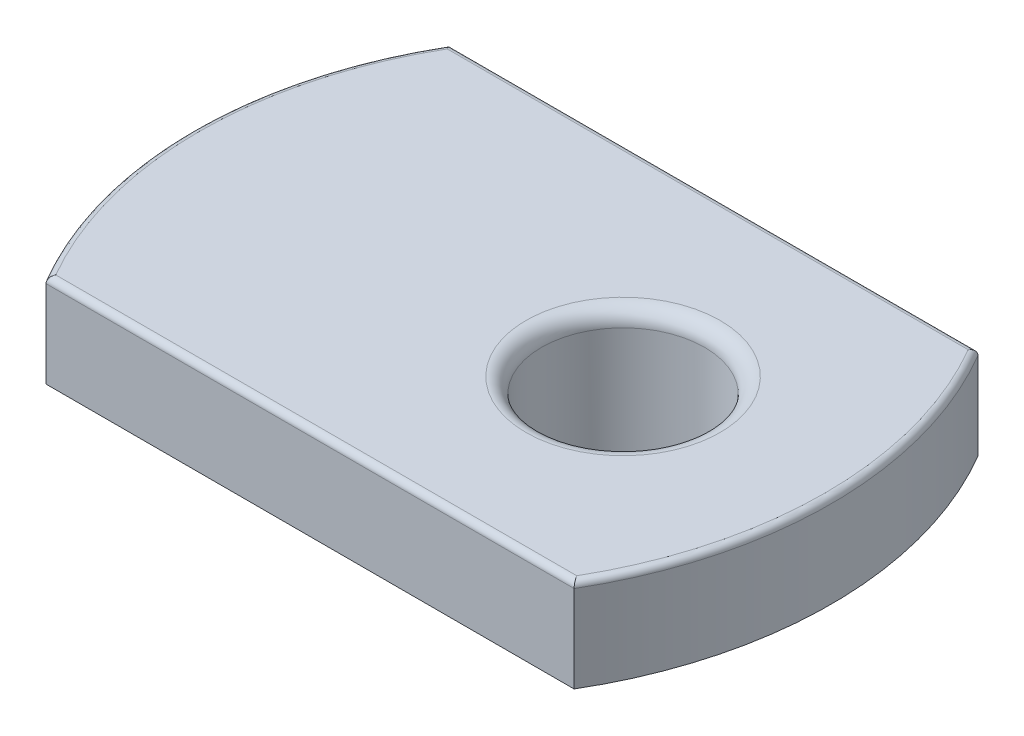
ISO-10303-21;
HEADER;
FILE_DESCRIPTION(('STEP AP214'),'2;1');
FILE_NAME('part.step','',(''),(''),'','','');
FILE_SCHEMA(('AUTOMOTIVE_DESIGN { 1 0 10303 214 1 1 1 1 }'));
ENDSEC;
DATA;
#1=APPLICATION_CONTEXT('core data for automotive mechanical design processes');
#2=APPLICATION_PROTOCOL_DEFINITION('international standard','automotive_design',2000,#1);
#3=PRODUCT_CONTEXT('',#1,'mechanical');
#4=PRODUCT('Part','Part','',(#3));
#5=PRODUCT_RELATED_PRODUCT_CATEGORY('part','',(#4));
#6=PRODUCT_DEFINITION_FORMATION('','',#4);
#7=PRODUCT_DEFINITION_CONTEXT('part definition',#1,'design');
#8=PRODUCT_DEFINITION('design','',#6,#7);
#9=PRODUCT_DEFINITION_SHAPE('','',#8);
#10=(LENGTH_UNIT() NAMED_UNIT(*) SI_UNIT(.MILLI.,.METRE.));
#11=(NAMED_UNIT(*) PLANE_ANGLE_UNIT() SI_UNIT($,.RADIAN.));
#12=(NAMED_UNIT(*) SI_UNIT($,.STERADIAN.) SOLID_ANGLE_UNIT());
#13=UNCERTAINTY_MEASURE_WITH_UNIT(LENGTH_MEASURE(1.E-05),#10,'distance_accuracy_value','');
#14=(GEOMETRIC_REPRESENTATION_CONTEXT(3) GLOBAL_UNCERTAINTY_ASSIGNED_CONTEXT((#13)) GLOBAL_UNIT_ASSIGNED_CONTEXT((#10,
#11,#12)) REPRESENTATION_CONTEXT('',''));
#15=CARTESIAN_POINT('',(0.,0.,0.));
#16=DIRECTION('',(0.,0.,1.));
#17=DIRECTION('',(1.,0.,0.));
#18=AXIS2_PLACEMENT_3D('',#15,#16,#17);
#19=CARTESIAN_POINT('',(-2.51390845070421,3.,0.));
#20=DIRECTION('',(0.,-1.,0.));
#21=DIRECTION('',(0.,0.,-1.));
#22=AXIS2_PLACEMENT_3D('',#19,#20,#21);
#23=CYLINDRICAL_SURFACE('',#22,12.7889084507042);
#24=DIRECTION('',(0.,-1.,0.));
#25=VECTOR('',#24,1.);
#26=CARTESIAN_POINT('',(8.5,3.,-6.5));
#27=LINE('',#26,#25);
#28=CARTESIAN_POINT('',(8.5,2.8,-6.5));
#29=VERTEX_POINT('',#28);
#30=CARTESIAN_POINT('',(8.5,0.,-6.5));
#31=VERTEX_POINT('',#30);
#32=EDGE_CURVE('E72',#29,#31,#27,.T.);
#33=ORIENTED_EDGE('',*,*,#32,.F.);
#34=CARTESIAN_POINT('',(-2.51390845070421,2.8,0.));
#35=DIRECTION('',(0.,-1.,0.));
#36=DIRECTION('',(0.,0.,-1.));
#37=AXIS2_PLACEMENT_3D('',#34,#35,#36);
#38=CIRCLE('',#37,12.7889084507042);
#39=CARTESIAN_POINT('',(8.5,2.8,6.5));
#40=VERTEX_POINT('',#39);
#41=EDGE_CURVE('E132',#29,#40,#38,.T.);
#42=ORIENTED_EDGE('',*,*,#41,.T.);
#43=DIRECTION('',(0.,-1.,0.));
#44=VECTOR('',#43,1.);
#45=CARTESIAN_POINT('',(8.5,3.,6.5));
#46=LINE('',#45,#44);
#47=CARTESIAN_POINT('',(8.5,0.,6.5));
#48=VERTEX_POINT('',#47);
#49=EDGE_CURVE('E92',#40,#48,#46,.T.);
#50=ORIENTED_EDGE('',*,*,#49,.T.);
#51=CARTESIAN_POINT('',(-2.51390845070421,0.,0.));
#52=DIRECTION('',(0.,1.,0.));
#53=DIRECTION('',(0.,0.,-1.));
#54=AXIS2_PLACEMENT_3D('',#51,#52,#53);
#55=CIRCLE('',#54,12.7889084507042);
#56=EDGE_CURVE('E87',#48,#31,#55,.T.);
#57=ORIENTED_EDGE('',*,*,#56,.T.);
#58=EDGE_LOOP('',(#33,#42,#50,#57));
#59=FACE_BOUND('',#58,.T.);
#60=ADVANCED_FACE('F16',(#59),#23,.T.);
#61=CARTESIAN_POINT('',(-8.5,3.,-6.5));
#62=DIRECTION('',(0.,0.,1.));
#63=DIRECTION('',(1.,0.,0.));
#64=AXIS2_PLACEMENT_3D('',#61,#62,#63);
#65=PLANE('',#64);
#66=DIRECTION('',(0.,-1.,0.));
#67=VECTOR('',#66,1.);
#68=CARTESIAN_POINT('',(-8.5,3.,-6.5));
#69=LINE('',#68,#67);
#70=CARTESIAN_POINT('',(-8.5,2.8,-6.5));
#71=VERTEX_POINT('',#70);
#72=CARTESIAN_POINT('',(-8.5,0.,-6.5));
#73=VERTEX_POINT('',#72);
#74=EDGE_CURVE('E81',#71,#73,#69,.T.);
#75=ORIENTED_EDGE('',*,*,#74,.F.);
#76=DIRECTION('',(-1.,0.,0.));
#77=VECTOR('',#76,1.);
#78=CARTESIAN_POINT('',(-8.5,2.8,-6.5));
#79=LINE('',#78,#77);
#80=EDGE_CURVE('E30',#71,#29,#79,.F.);
#81=ORIENTED_EDGE('',*,*,#80,.T.);
#82=ORIENTED_EDGE('',*,*,#32,.T.);
#83=DIRECTION('',(-1.,0.,0.));
#84=VECTOR('',#83,1.);
#85=CARTESIAN_POINT('',(-8.5,0.,-6.5));
#86=LINE('',#85,#84);
#87=EDGE_CURVE('E75',#31,#73,#86,.T.);
#88=ORIENTED_EDGE('',*,*,#87,.T.);
#89=EDGE_LOOP('',(#75,#81,#82,#88));
#90=FACE_BOUND('',#89,.T.);
#91=ADVANCED_FACE('F74',(#90),#65,.F.);
#92=CARTESIAN_POINT('',(2.51390845070421,3.,0.));
#93=DIRECTION('',(0.,-1.,0.));
#94=DIRECTION('',(0.,0.,-1.));
#95=AXIS2_PLACEMENT_3D('',#92,#93,#94);
#96=CYLINDRICAL_SURFACE('',#95,12.7889084507042);
#97=DIRECTION('',(0.,-1.,0.));
#98=VECTOR('',#97,1.);
#99=CARTESIAN_POINT('',(-8.5,3.,6.5));
#100=LINE('',#99,#98);
#101=CARTESIAN_POINT('',(-8.5,2.8,6.5));
#102=VERTEX_POINT('',#101);
#103=CARTESIAN_POINT('',(-8.5,0.,6.5));
#104=VERTEX_POINT('',#103);
#105=EDGE_CURVE('E103',#102,#104,#100,.T.);
#106=ORIENTED_EDGE('',*,*,#105,.F.);
#107=CARTESIAN_POINT('',(2.51390845070421,2.8,0.));
#108=DIRECTION('',(0.,-1.,0.));
#109=DIRECTION('',(0.,0.,-1.));
#110=AXIS2_PLACEMENT_3D('',#107,#108,#109);
#111=CIRCLE('',#110,12.7889084507042);
#112=EDGE_CURVE('E10',#102,#71,#111,.T.);
#113=ORIENTED_EDGE('',*,*,#112,.T.);
#114=ORIENTED_EDGE('',*,*,#74,.T.);
#115=CARTESIAN_POINT('',(2.51390845070421,0.,0.));
#116=DIRECTION('',(0.,1.,0.));
#117=DIRECTION('',(0.,0.,1.));
#118=AXIS2_PLACEMENT_3D('',#115,#116,#117);
#119=CIRCLE('',#118,12.7889084507042);
#120=EDGE_CURVE('E89',#73,#104,#119,.T.);
#121=ORIENTED_EDGE('',*,*,#120,.T.);
#122=EDGE_LOOP('',(#106,#113,#114,#121));
#123=FACE_BOUND('',#122,.T.);
#124=ADVANCED_FACE('F177',(#123),#96,.T.);
#125=CARTESIAN_POINT('',(-8.5,3.,6.5));
#126=DIRECTION('',(0.,0.,-1.));
#127=DIRECTION('',(-1.,0.,0.));
#128=AXIS2_PLACEMENT_3D('',#125,#126,#127);
#129=PLANE('',#128);
#130=ORIENTED_EDGE('',*,*,#49,.F.);
#131=DIRECTION('',(1.,0.,0.));
#132=VECTOR('',#131,1.);
#133=CARTESIAN_POINT('',(-8.5,2.8,6.5));
#134=LINE('',#133,#132);
#135=EDGE_CURVE('E129',#40,#102,#134,.F.);
#136=ORIENTED_EDGE('',*,*,#135,.T.);
#137=ORIENTED_EDGE('',*,*,#105,.T.);
#138=DIRECTION('',(1.,0.,0.));
#139=VECTOR('',#138,1.);
#140=CARTESIAN_POINT('',(-8.5,0.,6.5));
#141=LINE('',#140,#139);
#142=EDGE_CURVE('E100',#104,#48,#141,.T.);
#143=ORIENTED_EDGE('',*,*,#142,.T.);
#144=EDGE_LOOP('',(#130,#136,#137,#143));
#145=FACE_BOUND('',#144,.T.);
#146=ADVANCED_FACE('F176',(#145),#129,.F.);
#147=CARTESIAN_POINT('',(-2.51390845070421,3.,0.));
#148=DIRECTION('',(0.,-1.,0.));
#149=DIRECTION('',(0.,0.,-1.));
#150=AXIS2_PLACEMENT_3D('',#147,#148,#149);
#151=PLANE('',#150);
#152=CARTESIAN_POINT('',(2.51390845070421,3.,0.));
#153=DIRECTION('',(0.,-1.,0.));
#154=DIRECTION('',(0.,0.,-1.));
#155=AXIS2_PLACEMENT_3D('',#152,#153,#154);
#156=CIRCLE('',#155,12.5889084507042);
#157=CARTESIAN_POINT('',(-8.38520233780565,3.,-6.3));
#158=VERTEX_POINT('',#157);
#159=CARTESIAN_POINT('',(-8.38520233780565,3.,6.3));
#160=VERTEX_POINT('',#159);
#161=EDGE_CURVE('E120',#158,#160,#156,.F.);
#162=ORIENTED_EDGE('',*,*,#161,.T.);
#163=DIRECTION('',(1.,0.,0.));
#164=VECTOR('',#163,1.);
#165=CARTESIAN_POINT('',(-2.51390845070421,3.,6.3));
#166=LINE('',#165,#164);
#167=CARTESIAN_POINT('',(8.38520233780564,3.,6.3));
#168=VERTEX_POINT('',#167);
#169=EDGE_CURVE('E126',#160,#168,#166,.T.);
#170=ORIENTED_EDGE('',*,*,#169,.T.);
#171=CARTESIAN_POINT('',(-2.51390845070421,3.,0.));
#172=DIRECTION('',(0.,-1.,0.));
#173=DIRECTION('',(0.,0.,-1.));
#174=AXIS2_PLACEMENT_3D('',#171,#172,#173);
#175=CIRCLE('',#174,12.5889084507042);
#176=CARTESIAN_POINT('',(8.38520233780564,3.,-6.3));
#177=VERTEX_POINT('',#176);
#178=EDGE_CURVE('E124',#168,#177,#175,.F.);
#179=ORIENTED_EDGE('',*,*,#178,.T.);
#180=DIRECTION('',(-1.,0.,0.));
#181=VECTOR('',#180,1.);
#182=CARTESIAN_POINT('',(-2.51390845070421,3.,-6.3));
#183=LINE('',#182,#181);
#184=EDGE_CURVE('E122',#177,#158,#183,.T.);
#185=ORIENTED_EDGE('',*,*,#184,.T.);
#186=EDGE_LOOP('',(#162,#170,#179,#185));
#187=FACE_BOUND('',#186,.T.);
#188=CARTESIAN_POINT('',(3.575,3.,0.));
#189=DIRECTION('',(0.,-1.,0.));
#190=DIRECTION('',(0.,0.,-1.));
#191=AXIS2_PLACEMENT_3D('',#188,#189,#190);
#192=CIRCLE('',#191,3.125);
#193=CARTESIAN_POINT('',(3.575,3.,-3.125));
#194=VERTEX_POINT('',#193);
#195=EDGE_CURVE('E111',#194,#194,#192,.T.);
#196=ORIENTED_EDGE('',*,*,#195,.T.);
#197=EDGE_LOOP('',(#196));
#198=FACE_BOUND('',#197,.T.);
#199=ADVANCED_FACE('F181',(#187,#198),#151,.F.);
#200=CARTESIAN_POINT('',(-2.51390845070421,0.,0.));
#201=DIRECTION('',(0.,-1.,0.));
#202=DIRECTION('',(0.,0.,-1.));
#203=AXIS2_PLACEMENT_3D('',#200,#201,#202);
#204=PLANE('',#203);
#205=CARTESIAN_POINT('',(3.575,0.,0.));
#206=DIRECTION('',(0.,-1.,0.));
#207=DIRECTION('',(0.,0.,-1.));
#208=AXIS2_PLACEMENT_3D('',#205,#206,#207);
#209=CIRCLE('',#208,3.7);
#210=CARTESIAN_POINT('',(3.575,0.,-3.7));
#211=VERTEX_POINT('',#210);
#212=EDGE_CURVE('E80',#211,#211,#209,.T.);
#213=ORIENTED_EDGE('',*,*,#212,.F.);
#214=EDGE_LOOP('',(#213));
#215=FACE_BOUND('',#214,.T.);
#216=ORIENTED_EDGE('',*,*,#56,.F.);
#217=ORIENTED_EDGE('',*,*,#142,.F.);
#218=ORIENTED_EDGE('',*,*,#120,.F.);
#219=ORIENTED_EDGE('',*,*,#87,.F.);
#220=EDGE_LOOP('',(#216,#217,#218,#219));
#221=FACE_BOUND('',#220,.T.);
#222=ADVANCED_FACE('F85',(#215,#221),#204,.T.);
#223=CARTESIAN_POINT('',(3.575,-2.45,0.));
#224=DIRECTION('',(0.,1.,0.));
#225=DIRECTION('',(0.,0.,1.));
#226=AXIS2_PLACEMENT_3D('',#223,#224,#225);
#227=CYLINDRICAL_SURFACE('',#226,3.7);
#228=CARTESIAN_POINT('',(3.575,-1.95,0.));
#229=DIRECTION('',(0.,1.,0.));
#230=DIRECTION('',(0.,0.,1.));
#231=AXIS2_PLACEMENT_3D('',#228,#229,#230);
#232=CIRCLE('',#231,3.7);
#233=CARTESIAN_POINT('',(3.575,-1.95,3.7));
#234=VERTEX_POINT('',#233);
#235=EDGE_CURVE('E114',#234,#234,#232,.T.);
#236=ORIENTED_EDGE('',*,*,#235,.T.);
#237=EDGE_LOOP('',(#236));
#238=FACE_BOUND('',#237,.T.);
#239=ORIENTED_EDGE('',*,*,#212,.T.);
#240=EDGE_LOOP('',(#239));
#241=FACE_BOUND('',#240,.T.);
#242=ADVANCED_FACE('F202',(#238,#241),#227,.T.);
#243=CARTESIAN_POINT('',(3.575,-2.45,0.));
#244=DIRECTION('',(0.,1.,0.));
#245=DIRECTION('',(0.,0.,1.));
#246=AXIS2_PLACEMENT_3D('',#243,#244,#245);
#247=PLANE('',#246);
#248=CARTESIAN_POINT('',(3.575,-2.45,0.));
#249=DIRECTION('',(0.,1.,0.));
#250=DIRECTION('',(0.,0.,1.));
#251=AXIS2_PLACEMENT_3D('',#248,#249,#250);
#252=CIRCLE('',#251,3.2);
#253=CARTESIAN_POINT('',(3.575,-2.45,3.2));
#254=VERTEX_POINT('',#253);
#255=EDGE_CURVE('E117',#254,#254,#252,.F.);
#256=ORIENTED_EDGE('',*,*,#255,.T.);
#257=EDGE_LOOP('',(#256));
#258=FACE_BOUND('',#257,.T.);
#259=CARTESIAN_POINT('',(3.575,-2.45,0.));
#260=DIRECTION('',(0.,1.,0.));
#261=DIRECTION('',(0.,0.,1.));
#262=AXIS2_PLACEMENT_3D('',#259,#260,#261);
#263=CIRCLE('',#262,2.625);
#264=CARTESIAN_POINT('',(3.575,-2.45,2.625));
#265=VERTEX_POINT('',#264);
#266=EDGE_CURVE('E94',#265,#265,#263,.T.);
#267=ORIENTED_EDGE('',*,*,#266,.T.);
#268=EDGE_LOOP('',(#267));
#269=FACE_BOUND('',#268,.T.);
#270=ADVANCED_FACE('F197',(#258,#269),#247,.F.);
#271=CARTESIAN_POINT('',(3.575,-2.45,0.));
#272=DIRECTION('',(0.,1.,0.));
#273=DIRECTION('',(0.,0.,1.));
#274=AXIS2_PLACEMENT_3D('',#271,#272,#273);
#275=CYLINDRICAL_SURFACE('',#274,2.625);
#276=CARTESIAN_POINT('',(3.575,2.5,0.));
#277=DIRECTION('',(0.,-1.,0.));
#278=DIRECTION('',(0.,0.,-1.));
#279=AXIS2_PLACEMENT_3D('',#276,#277,#278);
#280=CIRCLE('',#279,2.625);
#281=CARTESIAN_POINT('',(3.575,2.5,-2.625));
#282=VERTEX_POINT('',#281);
#283=EDGE_CURVE('E108',#282,#282,#280,.F.);
#284=ORIENTED_EDGE('',*,*,#283,.T.);
#285=EDGE_LOOP('',(#284));
#286=FACE_BOUND('',#285,.T.);
#287=ORIENTED_EDGE('',*,*,#266,.F.);
#288=EDGE_LOOP('',(#287));
#289=FACE_BOUND('',#288,.T.);
#290=ADVANCED_FACE('F191',(#286,#289),#275,.F.);
#291=CARTESIAN_POINT('',(3.575,2.5,0.));
#292=DIRECTION('',(0.,-1.,0.));
#293=DIRECTION('',(0.,0.,-1.));
#294=AXIS2_PLACEMENT_3D('',#291,#292,#293);
#295=TOROIDAL_SURFACE('',#294,3.125,0.5);
#296=ORIENTED_EDGE('',*,*,#195,.F.);
#297=EDGE_LOOP('',(#296));
#298=FACE_BOUND('',#297,.T.);
#299=ORIENTED_EDGE('',*,*,#283,.F.);
#300=EDGE_LOOP('',(#299));
#301=FACE_BOUND('',#300,.T.);
#302=ADVANCED_FACE('F187',(#298,#301),#295,.T.);
#303=CARTESIAN_POINT('',(3.575,-1.95,0.));
#304=DIRECTION('',(0.,1.,0.));
#305=DIRECTION('',(0.,0.,1.));
#306=AXIS2_PLACEMENT_3D('',#303,#304,#305);
#307=CONICAL_SURFACE('',#306,3.7,0.785398163397451);
#308=ORIENTED_EDGE('',*,*,#255,.F.);
#309=EDGE_LOOP('',(#308));
#310=FACE_BOUND('',#309,.T.);
#311=ORIENTED_EDGE('',*,*,#235,.F.);
#312=EDGE_LOOP('',(#311));
#313=FACE_BOUND('',#312,.T.);
#314=ADVANCED_FACE('F190',(#310,#313),#307,.T.);
#315=CARTESIAN_POINT('',(-2.51390845070421,2.8,-6.3));
#316=DIRECTION('',(-1.,0.,0.));
#317=DIRECTION('',(0.,0.,1.));
#318=AXIS2_PLACEMENT_3D('',#315,#316,#317);
#319=CYLINDRICAL_SURFACE('',#318,0.2);
#320=CARTESIAN_POINT('',(8.5,2.8,-6.5));
#321=CARTESIAN_POINT('',(8.50000745142995,2.81019444334544,-6.50001322642434));
#322=CARTESIAN_POINT('',(8.49955547827552,2.82037757743437,-6.49922149853345));
#323=CARTESIAN_POINT('',(8.49779293995873,2.84039452977053,-6.49613500546002));
#324=CARTESIAN_POINT('',(8.49648601160734,2.85022964246567,-6.49384660682913));
#325=CARTESIAN_POINT('',(8.49307432190245,2.86930694502015,-6.48787450021161));
#326=CARTESIAN_POINT('',(8.4909702191424,2.87854961698036,-6.48419194402377));
#327=CARTESIAN_POINT('',(8.4860566186447,2.8962442985565,-6.47559561432051));
#328=CARTESIAN_POINT('',(8.48324655867504,2.90469567057321,-6.47068085947503));
#329=CARTESIAN_POINT('',(8.47686815790181,2.92104927868067,-6.45953037516586));
#330=CARTESIAN_POINT('',(8.47326869645224,2.92890224856563,-6.45324048107905));
#331=CARTESIAN_POINT('',(8.46552889010423,2.94344359196812,-6.43972324226624));
#332=CARTESIAN_POINT('',(8.46138839823726,2.95013164788608,-6.43249564282054));
#333=CARTESIAN_POINT('',(8.45213634196745,2.96303694169002,-6.41635552421829));
#334=CARTESIAN_POINT('',(8.44696807842534,2.96909117307684,-6.40734530178684));
#335=CARTESIAN_POINT('',(8.43623499606682,2.97960163836564,-6.38864787024181));
#336=CARTESIAN_POINT('',(8.43066980427347,2.98405634490289,-6.37896002456344));
#337=CARTESIAN_POINT('',(8.41880165220961,2.99165085105328,-6.35831664982718));
#338=CARTESIAN_POINT('',(8.41247586551277,2.9946500625686,-6.34732277020165));
#339=CARTESIAN_POINT('',(8.39967401938257,2.99874012286163,-6.32509382323473));
#340=CARTESIAN_POINT('',(8.3931982841202,2.99983475824154,-6.31385927951961));
#341=CARTESIAN_POINT('',(8.38621509526965,2.9999942322665,-6.30175523895919));
#342=CARTESIAN_POINT('',(8.38570870064733,3.00000000935386,-6.30087756101489));
#343=CARTESIAN_POINT('',(8.38520233780564,3.,-6.3));
#344=B_SPLINE_CURVE_WITH_KNOTS('',3,(#320,#321,#322,#323,#324,#325,#326,#327,#328,#329,#330,
#331,#332,#333,#334,#335,#336,#337,#338,#339,#340,#341,#342,#343),.UNSPECIFIED.,.F.,.F.,(4,2,2,
2,2,2,2,2,2,2,2,4),(0.,0.0305248933990669,0.0609207769421134,0.0912916031946474,
0.121686694209429,0.153616341405145,0.18555468024975,0.221480142433116,0.257439818695238,
0.296397481413258,0.335277601177469,0.338317439998827),.UNSPECIFIED.);
#345=EDGE_CURVE('E158',#29,#177,#344,.T.);
#346=ORIENTED_EDGE('',*,*,#345,.F.);
#347=ORIENTED_EDGE('',*,*,#80,.F.);
#348=CARTESIAN_POINT('',(-8.5,2.8,-6.5));
#349=CARTESIAN_POINT('',(-8.50000745142995,2.81019444334544,-6.50001322642434));
#350=CARTESIAN_POINT('',(-8.49955547827552,2.82037757743437,-6.49922149853345));
#351=CARTESIAN_POINT('',(-8.49779293995873,2.84039452977053,-6.49613500546002));
#352=CARTESIAN_POINT('',(-8.49648601160734,2.85022964246567,-6.49384660682913));
#353=CARTESIAN_POINT('',(-8.49307432190246,2.86930694502015,-6.48787450021161));
#354=CARTESIAN_POINT('',(-8.4909702191424,2.87854961698036,-6.48419194402377));
#355=CARTESIAN_POINT('',(-8.4860566186447,2.8962442985565,-6.47559561432051));
#356=CARTESIAN_POINT('',(-8.48324655867504,2.90469567057321,-6.47068085947503));
#357=CARTESIAN_POINT('',(-8.47686815790181,2.92104927868067,-6.45953037516586));
#358=CARTESIAN_POINT('',(-8.47326869645224,2.92890224856563,-6.45324048107905));
#359=CARTESIAN_POINT('',(-8.46552889010423,2.94344359196812,-6.43972324226624));
#360=CARTESIAN_POINT('',(-8.46138839823727,2.95013164788608,-6.43249564282054));
#361=CARTESIAN_POINT('',(-8.45213634196745,2.96303694169002,-6.41635552421829));
#362=CARTESIAN_POINT('',(-8.44696807842534,2.96909117307684,-6.40734530178684));
#363=CARTESIAN_POINT('',(-8.43623499606683,2.97960163836564,-6.38864787024181));
#364=CARTESIAN_POINT('',(-8.43066980427348,2.9840563449029,-6.37896002456344));
#365=CARTESIAN_POINT('',(-8.41880165220962,2.99165085105328,-6.35831664982718));
#366=CARTESIAN_POINT('',(-8.41247586551277,2.9946500625686,-6.34732277020165));
#367=CARTESIAN_POINT('',(-8.39967401938256,2.99874012286163,-6.32509382323474));
#368=CARTESIAN_POINT('',(-8.39319828412019,2.99983475824154,-6.31385927951962));
#369=CARTESIAN_POINT('',(-8.38621509526965,2.9999942322665,-6.30175523895919));
#370=CARTESIAN_POINT('',(-8.38570870064733,3.00000000935386,-6.30087756101489));
#371=CARTESIAN_POINT('',(-8.38520233780565,3.,-6.3));
#372=B_SPLINE_CURVE_WITH_KNOTS('',3,(#348,#349,#350,#351,#352,#353,#354,#355,#356,#357,#358,
#359,#360,#361,#362,#363,#364,#365,#366,#367,#368,#369,#370,#371),.UNSPECIFIED.,.F.,.F.,(4,2,2,
2,2,2,2,2,2,2,2,4),(0.,0.0305248933990672,0.0609207769421135,0.0912916031946468,
0.121686694209429,0.153616341405145,0.185554680249751,0.221480142433115,0.257439818695238,
0.296397481413259,0.335277601177468,0.338317439998826),.UNSPECIFIED.);
#373=EDGE_CURVE('E21',#158,#71,#372,.F.);
#374=ORIENTED_EDGE('',*,*,#373,.F.);
#375=ORIENTED_EDGE('',*,*,#184,.F.);
#376=EDGE_LOOP('',(#346,#347,#374,#375));
#377=FACE_BOUND('',#376,.T.);
#378=ADVANCED_FACE('F18',(#377),#319,.T.);
#379=CARTESIAN_POINT('',(2.51390845070421,2.8,0.));
#380=DIRECTION('',(0.,-1.,0.));
#381=DIRECTION('',(0.,0.,-1.));
#382=AXIS2_PLACEMENT_3D('',#379,#380,#381);
#383=TOROIDAL_SURFACE('',#382,12.5889084507042,0.2);
#384=ORIENTED_EDGE('',*,*,#373,.T.);
#385=ORIENTED_EDGE('',*,*,#112,.F.);
#386=CARTESIAN_POINT('',(-8.5,2.8,6.5));
#387=CARTESIAN_POINT('',(-8.50000745142995,2.81019444334544,6.50001322642434));
#388=CARTESIAN_POINT('',(-8.49955547827552,2.82037757743437,6.49922149853345));
#389=CARTESIAN_POINT('',(-8.49779293995873,2.84039452977053,6.49613500546002));
#390=CARTESIAN_POINT('',(-8.49648601160734,2.85022964246567,6.49384660682913));
#391=CARTESIAN_POINT('',(-8.49307432190246,2.86930694502015,6.48787450021161));
#392=CARTESIAN_POINT('',(-8.4909702191424,2.87854961698036,6.48419194402377));
#393=CARTESIAN_POINT('',(-8.4860566186447,2.8962442985565,6.47559561432051));
#394=CARTESIAN_POINT('',(-8.48324655867504,2.90469567057321,6.47068085947503));
#395=CARTESIAN_POINT('',(-8.47686815790181,2.92104927868067,6.45953037516586));
#396=CARTESIAN_POINT('',(-8.47326869645224,2.92890224856563,6.45324048107905));
#397=CARTESIAN_POINT('',(-8.46552889010423,2.94344359196812,6.43972324226624));
#398=CARTESIAN_POINT('',(-8.46138839823727,2.95013164788608,6.43249564282054));
#399=CARTESIAN_POINT('',(-8.45213634196745,2.96303694169002,6.41635552421829));
#400=CARTESIAN_POINT('',(-8.44696807842534,2.96909117307684,6.40734530178684));
#401=CARTESIAN_POINT('',(-8.43623499606683,2.97960163836564,6.38864787024181));
#402=CARTESIAN_POINT('',(-8.43066980427348,2.9840563449029,6.37896002456344));
#403=CARTESIAN_POINT('',(-8.41880165220962,2.99165085105328,6.35831664982718));
#404=CARTESIAN_POINT('',(-8.41247586551277,2.9946500625686,6.34732277020165));
#405=CARTESIAN_POINT('',(-8.39967401938256,2.99874012286163,6.32509382323474));
#406=CARTESIAN_POINT('',(-8.39319828412019,2.99983475824154,6.31385927951962));
#407=CARTESIAN_POINT('',(-8.38621509526965,2.9999942322665,6.30175523895919));
#408=CARTESIAN_POINT('',(-8.38570870064733,3.00000000935386,6.30087756101489));
#409=CARTESIAN_POINT('',(-8.38520233780565,3.,6.3));
#410=B_SPLINE_CURVE_WITH_KNOTS('',3,(#386,#387,#388,#389,#390,#391,#392,#393,#394,#395,#396,
#397,#398,#399,#400,#401,#402,#403,#404,#405,#406,#407,#408,#409),.UNSPECIFIED.,.F.,.F.,(4,2,2,
2,2,2,2,2,2,2,2,4),(0.,0.0305248933990672,0.0609207769421135,0.0912916031946467,
0.121686694209429,0.153616341405145,0.185554680249751,0.221480142433115,0.257439818695238,
0.296397481413259,0.335277601177468,0.338317439998826),.UNSPECIFIED.);
#411=EDGE_CURVE('E143',#160,#102,#410,.F.);
#412=ORIENTED_EDGE('',*,*,#411,.F.);
#413=ORIENTED_EDGE('',*,*,#161,.F.);
#414=EDGE_LOOP('',(#384,#385,#412,#413));
#415=FACE_BOUND('',#414,.T.);
#416=ADVANCED_FACE('F154',(#415),#383,.T.);
#417=CARTESIAN_POINT('',(-2.51390845070421,2.8,0.));
#418=DIRECTION('',(0.,-1.,0.));
#419=DIRECTION('',(0.,0.,-1.));
#420=AXIS2_PLACEMENT_3D('',#417,#418,#419);
#421=TOROIDAL_SURFACE('',#420,12.5889084507042,0.2);
#422=ORIENTED_EDGE('',*,*,#345,.T.);
#423=ORIENTED_EDGE('',*,*,#178,.F.);
#424=CARTESIAN_POINT('',(8.5,2.8,6.5));
#425=CARTESIAN_POINT('',(8.50000745142995,2.81019444334544,6.50001322642434));
#426=CARTESIAN_POINT('',(8.49955547827552,2.82037757743437,6.49922149853345));
#427=CARTESIAN_POINT('',(8.49779293995873,2.84039452977053,6.49613500546002));
#428=CARTESIAN_POINT('',(8.49648601160734,2.85022964246567,6.49384660682913));
#429=CARTESIAN_POINT('',(8.49307432190245,2.86930694502015,6.48787450021161));
#430=CARTESIAN_POINT('',(8.4909702191424,2.87854961698036,6.48419194402377));
#431=CARTESIAN_POINT('',(8.4860566186447,2.8962442985565,6.47559561432051));
#432=CARTESIAN_POINT('',(8.48324655867504,2.90469567057321,6.47068085947503));
#433=CARTESIAN_POINT('',(8.47686815790181,2.92104927868067,6.45953037516586));
#434=CARTESIAN_POINT('',(8.47326869645224,2.92890224856563,6.45324048107905));
#435=CARTESIAN_POINT('',(8.46552889010423,2.94344359196812,6.43972324226624));
#436=CARTESIAN_POINT('',(8.46138839823726,2.95013164788608,6.43249564282054));
#437=CARTESIAN_POINT('',(8.45213634196745,2.96303694169002,6.41635552421829));
#438=CARTESIAN_POINT('',(8.44696807842534,2.96909117307684,6.40734530178684));
#439=CARTESIAN_POINT('',(8.43623499606682,2.97960163836564,6.38864787024181));
#440=CARTESIAN_POINT('',(8.43066980427347,2.98405634490289,6.37896002456344));
#441=CARTESIAN_POINT('',(8.41880165220961,2.99165085105328,6.35831664982718));
#442=CARTESIAN_POINT('',(8.41247586551277,2.9946500625686,6.34732277020165));
#443=CARTESIAN_POINT('',(8.39967401938257,2.99874012286163,6.32509382323473));
#444=CARTESIAN_POINT('',(8.3931982841202,2.99983475824154,6.31385927951961));
#445=CARTESIAN_POINT('',(8.38621509526965,2.9999942322665,6.30175523895919));
#446=CARTESIAN_POINT('',(8.38570870064733,3.00000000935386,6.30087756101489));
#447=CARTESIAN_POINT('',(8.38520233780564,3.,6.3));
#448=B_SPLINE_CURVE_WITH_KNOTS('',3,(#424,#425,#426,#427,#428,#429,#430,#431,#432,#433,#434,
#435,#436,#437,#438,#439,#440,#441,#442,#443,#444,#445,#446,#447),.UNSPECIFIED.,.F.,.F.,(4,2,2,
2,2,2,2,2,2,2,2,4),(0.,0.0305248933990669,0.0609207769421134,0.0912916031946474,
0.121686694209429,0.153616341405145,0.18555468024975,0.221480142433116,0.257439818695238,
0.296397481413258,0.335277601177469,0.338317439998827),.UNSPECIFIED.);
#449=EDGE_CURVE('E135',#40,#168,#448,.T.);
#450=ORIENTED_EDGE('',*,*,#449,.F.);
#451=ORIENTED_EDGE('',*,*,#41,.F.);
#452=EDGE_LOOP('',(#422,#423,#450,#451));
#453=FACE_BOUND('',#452,.T.);
#454=ADVANCED_FACE('F151',(#453),#421,.T.);
#455=CARTESIAN_POINT('',(-2.51390845070421,2.8,6.3));
#456=DIRECTION('',(1.,0.,0.));
#457=DIRECTION('',(0.,0.,-1.));
#458=AXIS2_PLACEMENT_3D('',#455,#456,#457);
#459=CYLINDRICAL_SURFACE('',#458,0.2);
#460=ORIENTED_EDGE('',*,*,#411,.T.);
#461=ORIENTED_EDGE('',*,*,#135,.F.);
#462=ORIENTED_EDGE('',*,*,#449,.T.);
#463=ORIENTED_EDGE('',*,*,#169,.F.);
#464=EDGE_LOOP('',(#460,#461,#462,#463));
#465=FACE_BOUND('',#464,.T.);
#466=ADVANCED_FACE('F148',(#465),#459,.T.);
#467=CLOSED_SHELL('',(#60,#91,#124,#146,#199,#222,#242,#270,#290,#302,#314,#378,#416,#454,#466));
#468=MANIFOLD_SOLID_BREP('B1',#467);
#469=ADVANCED_BREP_SHAPE_REPRESENTATION('',(#18,#468),#14);
#470=SHAPE_DEFINITION_REPRESENTATION(#9,#469);
ENDSEC;
END-ISO-10303-21;
